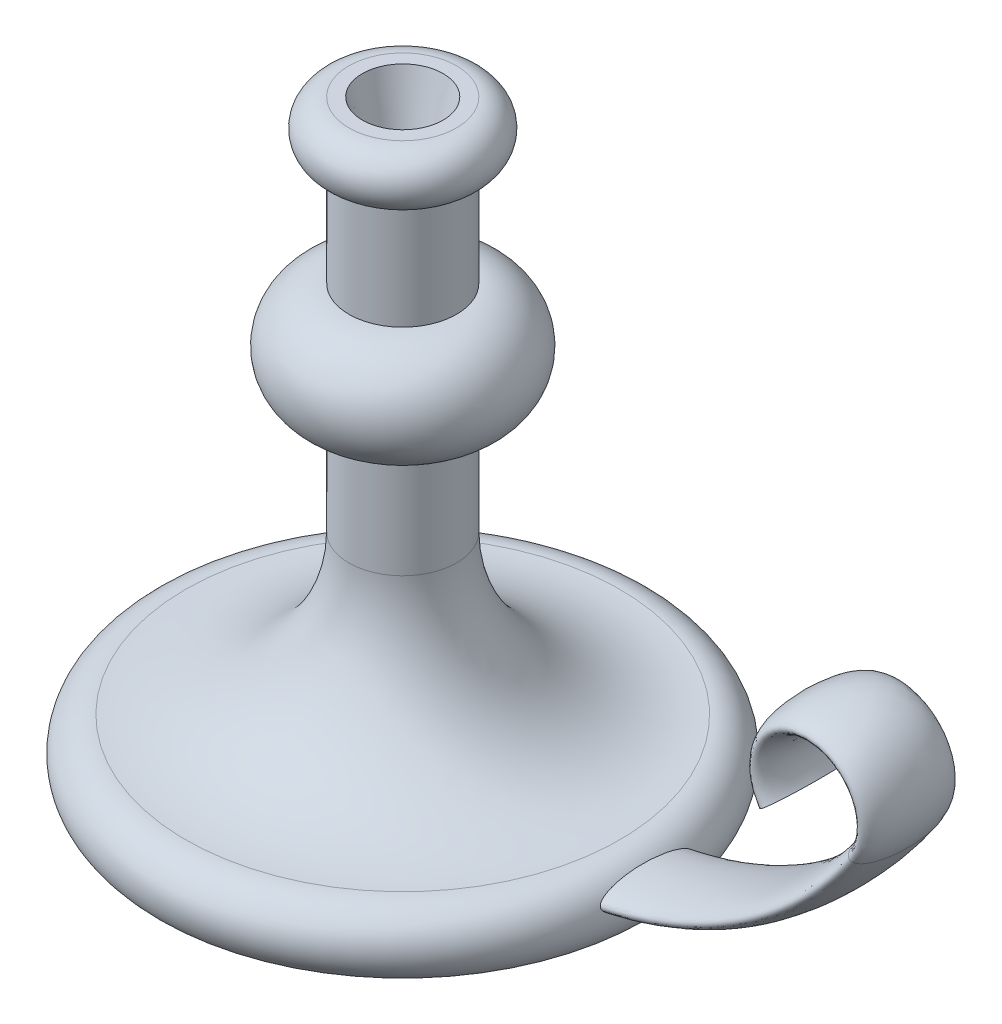
ISO-10303-21;
HEADER;
FILE_DESCRIPTION(('STEP AP214'),'2;1');
FILE_NAME('part.step','',(''),(''),'','','');
FILE_SCHEMA(('AUTOMOTIVE_DESIGN { 1 0 10303 214 1 1 1 1 }'));
ENDSEC;
DATA;
#1=APPLICATION_CONTEXT('core data for automotive mechanical design processes');
#2=APPLICATION_PROTOCOL_DEFINITION('international standard','automotive_design',2000,#1);
#3=PRODUCT_CONTEXT('',#1,'mechanical');
#4=PRODUCT('Part','Part','',(#3));
#5=PRODUCT_RELATED_PRODUCT_CATEGORY('part','',(#4));
#6=PRODUCT_DEFINITION_FORMATION('','',#4);
#7=PRODUCT_DEFINITION_CONTEXT('part definition',#1,'design');
#8=PRODUCT_DEFINITION('design','',#6,#7);
#9=PRODUCT_DEFINITION_SHAPE('','',#8);
#10=(LENGTH_UNIT() NAMED_UNIT(*) SI_UNIT(.MILLI.,.METRE.));
#11=(NAMED_UNIT(*) PLANE_ANGLE_UNIT() SI_UNIT($,.RADIAN.));
#12=(NAMED_UNIT(*) SI_UNIT($,.STERADIAN.) SOLID_ANGLE_UNIT());
#13=UNCERTAINTY_MEASURE_WITH_UNIT(LENGTH_MEASURE(1.E-05),#10,'distance_accuracy_value','');
#14=(GEOMETRIC_REPRESENTATION_CONTEXT(3) GLOBAL_UNCERTAINTY_ASSIGNED_CONTEXT((#13)) GLOBAL_UNIT_ASSIGNED_CONTEXT((#10,
#11,#12)) REPRESENTATION_CONTEXT('',''));
#15=CARTESIAN_POINT('',(0.,0.,0.));
#16=DIRECTION('',(0.,0.,1.));
#17=DIRECTION('',(1.,0.,0.));
#18=AXIS2_PLACEMENT_3D('',#15,#16,#17);
#19=CARTESIAN_POINT('',(0.,220.,0.));
#20=DIRECTION('',(0.,-1.,0.));
#21=DIRECTION('',(1.,0.,0.));
#22=AXIS2_PLACEMENT_3D('',#19,#20,#21);
#23=PLANE('',#22);
#24=CARTESIAN_POINT('',(0.,220.,0.));
#25=DIRECTION('',(0.,1.,0.));
#26=DIRECTION('',(-1.,0.,0.));
#27=AXIS2_PLACEMENT_3D('',#24,#25,#26);
#28=CIRCLE('',#27,15.);
#29=CARTESIAN_POINT('',(-15.,220.,0.));
#30=VERTEX_POINT('',#29);
#31=EDGE_CURVE('E83',#30,#30,#28,.T.);
#32=ORIENTED_EDGE('',*,*,#31,.F.);
#33=EDGE_LOOP('',(#32));
#34=FACE_BOUND('',#33,.T.);
#35=CARTESIAN_POINT('',(0.,220.,0.));
#36=DIRECTION('',(0.,1.,0.));
#37=DIRECTION('',(-1.,0.,0.));
#38=AXIS2_PLACEMENT_3D('',#35,#36,#37);
#39=CIRCLE('',#38,20.);
#40=CARTESIAN_POINT('',(-20.,220.,0.));
#41=VERTEX_POINT('',#40);
#42=EDGE_CURVE('E10',#41,#41,#39,.T.);
#43=ORIENTED_EDGE('',*,*,#42,.T.);
#44=EDGE_LOOP('',(#43));
#45=FACE_BOUND('',#44,.T.);
#46=ADVANCED_FACE('F41',(#34,#45),#23,.F.);
#47=CARTESIAN_POINT('',(0.,210.,0.));
#48=DIRECTION('',(0.,1.,0.));
#49=DIRECTION('',(-1.,0.,0.));
#50=AXIS2_PLACEMENT_3D('',#47,#48,#49);
#51=TOROIDAL_SURFACE('',#50,20.,10.);
#52=ORIENTED_EDGE('',*,*,#42,.F.);
#53=EDGE_LOOP('',(#52));
#54=FACE_BOUND('',#53,.T.);
#55=CARTESIAN_POINT('',(0.,200.,0.));
#56=DIRECTION('',(0.,1.,0.));
#57=DIRECTION('',(-1.,0.,0.));
#58=AXIS2_PLACEMENT_3D('',#55,#56,#57);
#59=CIRCLE('',#58,20.);
#60=CARTESIAN_POINT('',(-20.,200.,0.));
#61=VERTEX_POINT('',#60);
#62=EDGE_CURVE('E53',#61,#61,#59,.T.);
#63=ORIENTED_EDGE('',*,*,#62,.T.);
#64=EDGE_LOOP('',(#63));
#65=FACE_BOUND('',#64,.T.);
#66=ADVANCED_FACE('F90',(#54,#65),#51,.T.);
#67=CARTESIAN_POINT('',(0.,220.,0.));
#68=DIRECTION('',(0.,1.,0.));
#69=DIRECTION('',(-1.,0.,0.));
#70=AXIS2_PLACEMENT_3D('',#67,#68,#69);
#71=CYLINDRICAL_SURFACE('',#70,20.);
#72=ORIENTED_EDGE('',*,*,#62,.F.);
#73=EDGE_LOOP('',(#72));
#74=FACE_BOUND('',#73,.T.);
#75=CARTESIAN_POINT('',(0.,160.,0.));
#76=DIRECTION('',(0.,1.,0.));
#77=DIRECTION('',(-1.,0.,0.));
#78=AXIS2_PLACEMENT_3D('',#75,#76,#77);
#79=CIRCLE('',#78,20.);
#80=CARTESIAN_POINT('',(-20.,160.,0.));
#81=VERTEX_POINT('',#80);
#82=EDGE_CURVE('E57',#81,#81,#79,.T.);
#83=ORIENTED_EDGE('',*,*,#82,.T.);
#84=EDGE_LOOP('',(#83));
#85=FACE_BOUND('',#84,.T.);
#86=ADVANCED_FACE('F94',(#74,#85),#71,.T.);
#87=CARTESIAN_POINT('',(0.,140.,0.));
#88=DIRECTION('',(0.,1.,0.));
#89=DIRECTION('',(-1.,0.,0.));
#90=AXIS2_PLACEMENT_3D('',#87,#88,#89);
#91=TOROIDAL_SURFACE('',#90,20.,20.);
#92=ORIENTED_EDGE('',*,*,#82,.F.);
#93=EDGE_LOOP('',(#92));
#94=FACE_BOUND('',#93,.T.);
#95=CARTESIAN_POINT('',(0.,120.,0.));
#96=DIRECTION('',(0.,1.,0.));
#97=DIRECTION('',(-1.,0.,0.));
#98=AXIS2_PLACEMENT_3D('',#95,#96,#97);
#99=CIRCLE('',#98,20.);
#100=CARTESIAN_POINT('',(-20.,120.,0.));
#101=VERTEX_POINT('',#100);
#102=EDGE_CURVE('E62',#101,#101,#99,.T.);
#103=ORIENTED_EDGE('',*,*,#102,.T.);
#104=EDGE_LOOP('',(#103));
#105=FACE_BOUND('',#104,.T.);
#106=ADVANCED_FACE('F99',(#94,#105),#91,.T.);
#107=CARTESIAN_POINT('',(0.,220.,0.));
#108=DIRECTION('',(0.,1.,0.));
#109=DIRECTION('',(-1.,0.,0.));
#110=AXIS2_PLACEMENT_3D('',#107,#108,#109);
#111=CYLINDRICAL_SURFACE('',#110,20.);
#112=ORIENTED_EDGE('',*,*,#102,.F.);
#113=EDGE_LOOP('',(#112));
#114=FACE_BOUND('',#113,.T.);
#115=CARTESIAN_POINT('',(0.,80.,0.));
#116=DIRECTION('',(0.,1.,0.));
#117=DIRECTION('',(-1.,0.,0.));
#118=AXIS2_PLACEMENT_3D('',#115,#116,#117);
#119=CIRCLE('',#118,20.);
#120=CARTESIAN_POINT('',(-20.0000000000001,80.,0.));
#121=VERTEX_POINT('',#120);
#122=EDGE_CURVE('E65',#121,#121,#119,.T.);
#123=ORIENTED_EDGE('',*,*,#122,.T.);
#124=EDGE_LOOP('',(#123));
#125=FACE_BOUND('',#124,.T.);
#126=ADVANCED_FACE('F106',(#114,#125),#111,.T.);
#127=CARTESIAN_POINT('',(0.,79.9999999999999,0.));
#128=DIRECTION('',(0.,1.,0.));
#129=DIRECTION('',(-1.,0.,0.));
#130=AXIS2_PLACEMENT_3D('',#127,#128,#129);
#131=TOROIDAL_SURFACE('',#130,78.8204265996985,58.8204265996985);
#132=ORIENTED_EDGE('',*,*,#122,.F.);
#133=EDGE_LOOP('',(#132));
#134=FACE_BOUND('',#133,.T.);
#135=CARTESIAN_POINT('',(0.,21.2080168194294,0.));
#136=DIRECTION('',(0.,1.,0.));
#137=DIRECTION('',(-1.,0.,0.));
#138=AXIS2_PLACEMENT_3D('',#135,#136,#137);
#139=CIRCLE('',#138,80.6494424733396);
#140=CARTESIAN_POINT('',(-80.6494424733396,21.2080168194294,0.));
#141=VERTEX_POINT('',#140);
#142=EDGE_CURVE('E68',#141,#141,#139,.T.);
#143=ORIENTED_EDGE('',*,*,#142,.T.);
#144=EDGE_LOOP('',(#143));
#145=FACE_BOUND('',#144,.T.);
#146=ADVANCED_FACE('F110',(#134,#145),#131,.F.);
#147=CARTESIAN_POINT('',(0.,8.71406136483062,0.));
#148=DIRECTION('',(0.,1.,0.));
#149=DIRECTION('',(-1.,0.,0.));
#150=AXIS2_PLACEMENT_3D('',#147,#148,#149);
#151=TOROIDAL_SURFACE('',#150,81.0381288488415,12.5);
#152=CARTESIAN_POINT('',(91.0218392214389,13.2429030972635,-17.5));
#153=CARTESIAN_POINT('',(91.0387237271424,13.2002476881049,-17.5000010450082));
#154=CARTESIAN_POINT('',(91.0557256233928,13.1576463015099,-17.4978455510409));
#155=CARTESIAN_POINT('',(91.08982673329,13.0729013238701,-17.4893177006165));
#156=CARTESIAN_POINT('',(91.1069259737739,13.0307578694164,-17.4829441192878));
#157=CARTESIAN_POINT('',(91.1581944372523,12.9054382936846,-17.4577561719923));
#158=CARTESIAN_POINT('',(91.1923166826997,12.8234177058011,-17.4328749261469));
#159=CARTESIAN_POINT('',(91.2690475015181,12.6418603320258,-17.3606410003538));
#160=CARTESIAN_POINT('',(91.3113126896798,12.5439679698587,-17.3089122311868));
#161=CARTESIAN_POINT('',(91.3933694533119,12.3573702711873,-17.1893973539373));
#162=CARTESIAN_POINT('',(91.4331545886019,12.2686884852105,-17.1215714729396));
#163=CARTESIAN_POINT('',(91.505463574309,12.1101803480161,-16.9835994785153));
#164=CARTESIAN_POINT('',(91.5382854213837,12.039368843571,-16.9147121478811));
#165=CARTESIAN_POINT('',(91.6020617404435,11.9036348173224,-16.7705071809718));
#166=CARTESIAN_POINT('',(91.6330146036928,11.8387173452948,-16.6951841360838));
#167=CARTESIAN_POINT('',(91.6932559853178,11.7139518609917,-16.5396246780461));
#168=CARTESIAN_POINT('',(91.722541410897,11.654113174187,-16.4593796735374));
#169=CARTESIAN_POINT('',(91.779560231776,11.5389593308511,-16.2952422137553));
#170=CARTESIAN_POINT('',(91.80729407397,11.4836428696683,-16.2113508212303));
#171=CARTESIAN_POINT('',(91.8651736049462,11.3694451361373,-16.0287299301955));
#172=CARTESIAN_POINT('',(91.8951122232932,11.3111515442047,-15.929569221302));
#173=CARTESIAN_POINT('',(91.9533999684463,11.1989441897543,-15.7283485441093));
#174=CARTESIAN_POINT('',(91.9817489100778,11.1450309371565,-15.6262882401263));
#175=CARTESIAN_POINT('',(92.0369779426886,11.0411030461374,-15.4200379172818));
#176=CARTESIAN_POINT('',(92.0638603063223,10.9910823212896,-15.3158515584475));
#177=CARTESIAN_POINT('',(92.1163401066507,10.8943887060286,-15.1056348437027));
#178=CARTESIAN_POINT('',(92.1419376232365,10.8477156073839,-14.9996046029973));
#179=CARTESIAN_POINT('',(92.2005199418423,10.7418774740482,-14.749494354725));
#180=CARTESIAN_POINT('',(92.2330372212628,10.6838992432133,-14.6048030012611));
#181=CARTESIAN_POINT('',(92.2961935918206,10.5725469519067,-14.313244632093));
#182=CARTESIAN_POINT('',(92.3268324204339,10.5191735345611,-14.1663773158309));
#183=CARTESIAN_POINT('',(92.3864357534422,10.4164111992929,-13.8707358868182));
#184=CARTESIAN_POINT('',(92.415398373899,10.3670267409322,-13.7219598496574));
#185=CARTESIAN_POINT('',(92.4717537495937,10.2718508982848,-13.422964440171));
#186=CARTESIAN_POINT('',(92.4991464054596,10.2260597413705,-13.2727449771839));
#187=CARTESIAN_POINT('',(92.5791718538912,10.09345947671,-12.8201450664608));
#188=CARTESIAN_POINT('',(92.6296248158832,10.0114703155529,-12.5159601751972));
#189=CARTESIAN_POINT('',(92.7256509795061,9.85770615403591,-11.9025949872641));
#190=CARTESIAN_POINT('',(92.7711976361288,9.78598608702627,-11.5933970058159));
#191=CARTESIAN_POINT('',(92.857568269172,9.65172377774597,-10.9726212442378));
#192=CARTESIAN_POINT('',(92.8983957881055,9.58917464154142,-10.6610454388513));
#193=CARTESIAN_POINT('',(92.9757170765173,9.47203235998278,-10.0359313731458));
#194=CARTESIAN_POINT('',(93.0122115267146,9.41743796464287,-9.72239342924477));
#195=CARTESIAN_POINT('',(93.0839389434969,9.3111693379989,-9.06820396965003));
#196=CARTESIAN_POINT('',(93.1188288179072,9.26009224748253,-8.72741824390393));
#197=CARTESIAN_POINT('',(93.1841160733915,9.16535652767351,-8.04438148717035));
#198=CARTESIAN_POINT('',(93.2145132603926,9.12169821884143,-7.7021303935394));
#199=CARTESIAN_POINT('',(93.271012519265,9.04115155210228,-7.01638121626511));
#200=CARTESIAN_POINT('',(93.2971133489208,9.004265151818,-6.67288280121893));
#201=CARTESIAN_POINT('',(93.3451537997318,8.93679113480079,-5.98497371045576));
#202=CARTESIAN_POINT('',(93.3670932781325,8.90620373415108,-5.64056300385354));
#203=CARTESIAN_POINT('',(93.4267381815512,8.82344746410236,-4.60806585396849));
#204=CARTESIAN_POINT('',(93.4584177235097,8.78007657489712,-3.91890377289669));
#205=CARTESIAN_POINT('',(93.5062518933377,8.71486697491152,-2.53904459995606));
#206=CARTESIAN_POINT('',(93.5224060871702,8.6930288661157,-1.84834746571327));
#207=CARTESIAN_POINT('',(93.5384150423668,8.67139588101243,-0.549996569407947));
#208=CARTESIAN_POINT('',(93.5400047236096,8.66925458453172,0.0575983568372195));
#209=CARTESIAN_POINT('',(93.5314017384323,8.68087045506801,1.27264756848925));
#210=CARTESIAN_POINT('',(93.5212073043764,8.69463000723722,1.8801018191223));
#211=CARTESIAN_POINT('',(93.4889027208428,8.7384904131166,3.09430826504117));
#212=CARTESIAN_POINT('',(93.4667887326513,8.76859653129061,3.70106017101466));
#213=CARTESIAN_POINT('',(93.4102999361791,8.8462260956102,4.91398988569018));
#214=CARTESIAN_POINT('',(93.3759030279974,8.89378094044514,5.52016467198355));
#215=CARTESIAN_POINT('',(93.2943595907772,9.00800592306139,6.72974297132933));
#216=CARTESIAN_POINT('',(93.2472164422581,9.07467099276872,7.3331471760958));
#217=CARTESIAN_POINT('',(93.1663269057562,9.19110129324903,8.23503212277021));
#218=CARTESIAN_POINT('',(93.137676306246,9.23263781601772,8.53504939957939));
#219=CARTESIAN_POINT('',(93.0768277820127,9.32170425147748,9.13382743847568));
#220=CARTESIAN_POINT('',(93.0446300100418,9.36923390609862,9.43258825409512));
#221=CARTESIAN_POINT('',(92.9764629967327,9.47096640593128,10.0288581938314));
#222=CARTESIAN_POINT('',(92.940489997118,9.52517591052781,10.3263657580075));
#223=CARTESIAN_POINT('',(92.8645434850019,9.64106284984119,10.919465661459));
#224=CARTESIAN_POINT('',(92.8245693802273,9.70274139046458,11.21505771027));
#225=CARTESIAN_POINT('',(92.7402632087426,9.83469285963899,11.8039351577575));
#226=CARTESIAN_POINT('',(92.6959280509754,9.90497189284494,12.0972187588887));
#227=CARTESIAN_POINT('',(92.6025776730023,10.0553946041886,12.6797774700146));
#228=CARTESIAN_POINT('',(92.5535734028715,10.135515323251,12.9690602215732));
#229=CARTESIAN_POINT('',(92.4501940228296,10.3077493433548,13.5429619485965));
#230=CARTESIAN_POINT('',(92.3958218177353,10.3998561667006,13.827583350341));
#231=CARTESIAN_POINT('',(92.3095576658701,10.5492476463075,14.2493983603303));
#232=CARTESIAN_POINT('',(92.2800345732429,10.6008880643727,14.389081965422));
#233=CARTESIAN_POINT('',(92.2192495390011,10.7084556526518,14.666398704985));
#234=CARTESIAN_POINT('',(92.1879877882503,10.7643823525861,14.8040320624309));
#235=CARTESIAN_POINT('',(92.1229963357037,10.8821323129919,15.0789842751265));
#236=CARTESIAN_POINT('',(92.0892344863866,10.944037464005,15.2162606818074));
#237=CARTESIAN_POINT('',(92.0194326577583,11.0738463544431,15.487436549884));
#238=CARTESIAN_POINT('',(91.9833919665493,11.1417519710408,15.6213349375471));
#239=CARTESIAN_POINT('',(91.9088363081799,11.2844351476636,15.8840885039224));
#240=CARTESIAN_POINT('',(91.8703306214983,11.3591873417771,16.0129599623785));
#241=CARTESIAN_POINT('',(91.7903231869532,11.5172184910703,16.264342709207));
#242=CARTESIAN_POINT('',(91.7488237961295,11.600490759272,16.3868588734261));
#243=CARTESIAN_POINT('',(91.6677322485553,11.7663982109835,16.6079145689105));
#244=CARTESIAN_POINT('',(91.6285584376418,11.8477920816342,16.7075302401066));
#245=CARTESIAN_POINT('',(91.5469777422452,12.0205144146608,16.8970368877778));
#246=CARTESIAN_POINT('',(91.5045640197906,12.1118640726817,16.9869062704744));
#247=CARTESIAN_POINT('',(91.4380483127567,12.2581701532586,17.1110794609954));
#248=CARTESIAN_POINT('',(91.4151921305341,12.3089462100449,17.1509837393849));
#249=CARTESIAN_POINT('',(91.3686001083926,12.4136019083811,17.2259928563444));
#250=CARTESIAN_POINT('',(91.3448641115573,12.4674821045184,17.2610968334868));
#251=CARTESIAN_POINT('',(91.2966903130685,12.5781105716414,17.3252675570636));
#252=CARTESIAN_POINT('',(91.2722560228595,12.6348453122441,17.3543599608046));
#253=CARTESIAN_POINT('',(91.2227756992792,12.751121890448,17.4054703044572));
#254=CARTESIAN_POINT('',(91.1977302297037,12.8106611848378,17.42749451749));
#255=CARTESIAN_POINT('',(91.1410771944871,12.9470124234379,17.4676994584011));
#256=CARTESIAN_POINT('',(91.1093676315408,13.024477396563,17.4836104825565));
#257=CARTESIAN_POINT('',(91.0462370284459,13.1811095530926,17.5009169471864));
#258=CARTESIAN_POINT('',(91.0148158270557,13.2602756905549,17.5023210648644));
#259=CARTESIAN_POINT('',(90.9531839913537,13.4178903951082,17.4904060494174));
#260=CARTESIAN_POINT('',(90.9229726197553,13.4963393760341,17.4770960292584));
#261=CARTESIAN_POINT('',(90.86442681096,13.6504791561979,17.437121949978));
#262=CARTESIAN_POINT('',(90.8360942951915,13.7261670973129,17.4104444518886));
#263=CARTESIAN_POINT('',(90.7703570694519,13.9039847662509,17.3325924653588));
#264=CARTESIAN_POINT('',(90.734063025823,14.0040624046424,17.2758469027692));
#265=CARTESIAN_POINT('',(90.6658119508761,14.195026715119,17.1465368030925));
#266=CARTESIAN_POINT('',(90.6338663052993,14.2858891056301,17.0739319863792));
#267=CARTESIAN_POINT('',(90.5767998907113,14.4501776256653,16.9257752102006));
#268=CARTESIAN_POINT('',(90.5513155909637,14.5244376822049,16.8512661984322));
#269=CARTESIAN_POINT('',(90.5028908556559,14.6668472266296,16.6957998671665));
#270=CARTESIAN_POINT('',(90.4799526685986,14.7349913034129,16.6148369548542));
#271=CARTESIAN_POINT('',(90.4361642018432,14.8660732250277,16.4479752839859));
#272=CARTESIAN_POINT('',(90.4153191927272,14.9289978614348,16.3620648824458));
#273=CARTESIAN_POINT('',(90.3754359846482,15.050152434354,16.1866658763681));
#274=CARTESIAN_POINT('',(90.3563971328333,15.1083840660407,16.0971785814825));
#275=CARTESIAN_POINT('',(90.3195006263767,15.221809759901,15.9137412560003));
#276=CARTESIAN_POINT('',(90.3016708994802,15.2769289097323,15.81973956638));
#277=CARTESIAN_POINT('',(90.2673446284714,15.3834812490698,15.6294239161183));
#278=CARTESIAN_POINT('',(90.250848322113,15.4349137810535,15.5331095470709));
#279=CARTESIAN_POINT('',(90.2030174296424,15.5844992870425,15.2410936889848));
#280=CARTESIAN_POINT('',(90.17339639789,15.6777684404554,15.0426047503192));
#281=CARTESIAN_POINT('',(90.1175941173176,15.8539596330478,14.6404944087312));
#282=CARTESIAN_POINT('',(90.0914158890751,15.9368725829473,14.4368686831971));
#283=CARTESIAN_POINT('',(90.0416849833099,16.0944302433251,14.0251133598403));
#284=CARTESIAN_POINT('',(90.0181443015335,16.1690371683792,13.8169679475742));
#285=CARTESIAN_POINT('',(89.9733292907841,16.3108246572343,13.3982065197802));
#286=CARTESIAN_POINT('',(89.9520524360155,16.378013500755,13.1875935550073));
#287=CARTESIAN_POINT('',(89.9113753607474,16.5060416166984,12.7643407233213));
#288=CARTESIAN_POINT('',(89.8919746398093,16.5668825826935,12.5517014136311));
#289=CARTESIAN_POINT('',(89.849689734785,16.6988851969988,12.0664042902698));
#290=CARTESIAN_POINT('',(89.827303648487,16.7683197752758,11.7932342142552));
#291=CARTESIAN_POINT('',(89.7847399444103,16.8993897784799,11.2448451823775));
#292=CARTESIAN_POINT('',(89.7645625501311,16.961024414222,10.9696260221697));
#293=CARTESIAN_POINT('',(89.7261443388086,17.0774237057835,10.4174622394428));
#294=CARTESIAN_POINT('',(89.7079045187843,17.1321848272996,10.1405168054847));
#295=CARTESIAN_POINT('',(89.673191480252,17.2355001446269,9.58535578516326));
#296=CARTESIAN_POINT('',(89.6567183450058,17.2840540479199,9.30714013957989));
#297=CARTESIAN_POINT('',(89.6098418487414,17.4209981276742,8.47258351512837));
#298=CARTESIAN_POINT('',(89.5818709393478,17.5010033813077,7.91471752766468));
#299=CARTESIAN_POINT('',(89.5318782113459,17.6417650717487,6.79648556429593));
#300=CARTESIAN_POINT('',(89.5098550083066,17.7025259885764,6.23612020108643));
#301=CARTESIAN_POINT('',(89.4715961567931,17.8067228687609,5.11511479744723));
#302=CARTESIAN_POINT('',(89.4553451258032,17.8502049166816,4.5544795353117));
#303=CARTESIAN_POINT('',(89.4284966459205,17.9213978205087,3.43205273933566));
#304=CARTESIAN_POINT('',(89.4178995226105,17.9491077681778,2.87026114077662));
#305=CARTESIAN_POINT('',(89.4023700642639,17.9895383139046,1.74600450065262));
#306=CARTESIAN_POINT('',(89.397438340362,18.0022572948694,1.18353939298514));
#307=CARTESIAN_POINT('',(89.3932573100072,18.013047530467,0.0584630429635961));
#308=CARTESIAN_POINT('',(89.3940078605346,18.0111191537656,-0.504148195356027));
#309=CARTESIAN_POINT('',(89.4011862427475,17.9925685699135,-1.62877069375065));
#310=CARTESIAN_POINT('',(89.4076108125585,17.9759548050793,-2.19078211282294));
#311=CARTESIAN_POINT('',(89.4261152567334,17.9275888415274,-3.3140874002313));
#312=CARTESIAN_POINT('',(89.4381953329093,17.8958361025867,-3.87538124224446));
#313=CARTESIAN_POINT('',(89.4680278902417,17.8162319822171,-4.99734675397808));
#314=CARTESIAN_POINT('',(89.4857870295396,17.7683617010583,-5.55801691435686));
#315=CARTESIAN_POINT('',(89.5270487170515,17.655058415788,-6.67735290890778));
#316=CARTESIAN_POINT('',(89.5505507406534,17.5896270158303,-7.23601892143143));
#317=CARTESIAN_POINT('',(89.5922123610219,17.4712124574237,-8.11144011809288));
#318=CARTESIAN_POINT('',(89.6083414978801,17.4249222943288,-8.4292052408542));
#319=CARTESIAN_POINT('',(89.6426776988952,17.3252459244219,-9.06353315837383));
#320=CARTESIAN_POINT('',(89.6608848665617,17.2718593641066,-9.38009589242721));
#321=CARTESIAN_POINT('',(89.6995463411571,17.1572165517864,-10.0117529664032));
#322=CARTESIAN_POINT('',(89.7200012677411,17.0959581288995,-10.3268468763239));
#323=CARTESIAN_POINT('',(89.7633490855456,16.9647664672953,-10.9541447499507));
#324=CARTESIAN_POINT('',(89.7862349923713,16.8948579902991,-11.2663543341677));
#325=CARTESIAN_POINT('',(89.8348735399245,16.7449224096902,-11.8880526187848));
#326=CARTESIAN_POINT('',(89.8606255734877,16.6648974486817,-12.1975418805298));
#327=CARTESIAN_POINT('',(89.9155758463715,16.4929428713543,-12.8127795932354));
#328=CARTESIAN_POINT('',(89.9447723782013,16.4010191512554,-13.1185298154237));
#329=CARTESIAN_POINT('',(89.9901864913607,16.2575097730331,-13.557054198979));
#330=CARTESIAN_POINT('',(90.0046462277531,16.2117493613147,-13.6919261319589));
#331=CARTESIAN_POINT('',(90.0345661378114,16.1169961747357,-13.9604247039184));
#332=CARTESIAN_POINT('',(90.0500263188945,16.0680033759105,-14.094051333657));
#333=CARTESIAN_POINT('',(90.0821318664633,15.9662860764166,-14.360121742191));
#334=CARTESIAN_POINT('',(90.0987800706745,15.9135526427458,-14.4925617763892));
#335=CARTESIAN_POINT('',(90.1334153884612,15.8039938816352,-14.7555602791059));
#336=CARTESIAN_POINT('',(90.1514024365647,15.7471687542912,-14.8861188392599));
#337=CARTESIAN_POINT('',(90.1909444520427,15.622577872307,-15.1585765358867));
#338=CARTESIAN_POINT('',(90.2126755571481,15.5542907138133,-15.3002135620826));
#339=CARTESIAN_POINT('',(90.2585123771174,15.4109493265847,-15.5797403637165));
#340=CARTESIAN_POINT('',(90.2826191238791,15.3358921583983,-15.7176284772802));
#341=CARTESIAN_POINT('',(90.3336960644792,15.1779918768142,-15.9876667226701));
#342=CARTESIAN_POINT('',(90.3606553160639,15.095178646876,-16.119836224442));
#343=CARTESIAN_POINT('',(90.4182965589345,14.9198501153096,-16.3766482828942));
#344=CARTESIAN_POINT('',(90.4489742837141,14.8273459491186,-16.5012992247445));
#345=CARTESIAN_POINT('',(90.5083259171889,14.6507402239064,-16.7147573665486));
#346=CARTESIAN_POINT('',(90.5360990560993,14.5688659703857,-16.80564150509));
#347=CARTESIAN_POINT('',(90.5954966053098,14.3960192072345,-16.9775509986329));
#348=CARTESIAN_POINT('',(90.6271273436289,14.3050317932496,-17.0585597066897));
#349=CARTESIAN_POINT('',(90.6782405709683,14.1603299223934,-17.1694834790196));
#350=CARTESIAN_POINT('',(90.6960555843429,14.1102682181019,-17.2049457829461));
#351=CARTESIAN_POINT('',(90.732939653224,14.0075205127295,-17.2711792990068));
#352=CARTESIAN_POINT('',(90.7520089418508,13.9548340242486,-17.3019496355424));
#353=CARTESIAN_POINT('',(90.7913328871427,13.8472131800932,-17.3577030771711));
#354=CARTESIAN_POINT('',(90.8115817364892,13.7922901813172,-17.3827119545785));
#355=CARTESIAN_POINT('',(90.8532728609314,13.6803548625301,-17.426099014347));
#356=CARTESIAN_POINT('',(90.8747139060557,13.6233447158115,-17.4444838892839));
#357=CARTESIAN_POINT('',(90.9168039777965,13.5126333832182,-17.4725282104178));
#358=CARTESIAN_POINT('',(90.9373696287499,13.459053425713,-17.4827880802029));
#359=CARTESIAN_POINT('',(90.9791734544596,13.3512544554109,-17.4965242253452));
#360=CARTESIAN_POINT('',(91.0004118087682,13.2970352744639,-17.4999986738243));
#361=CARTESIAN_POINT('',(91.0218392214389,13.2429030972635,-17.5));
#362=B_SPLINE_CURVE_WITH_KNOTS('',3,(#152,#153,#154,#155,#156,#157,#158,#159,#160,#161,#162,
#163,#164,#165,#166,#167,#168,#169,#170,#171,#172,#173,#174,#175,#176,#177,#178,#179,#180,#181,
#182,#183,#184,#185,#186,#187,#188,#189,#190,#191,#192,#193,#194,#195,#196,#197,#198,#199,#200,
#201,#202,#203,#204,#205,#206,#207,#208,#209,#210,#211,#212,#213,#214,#215,#216,#217,#218,#219,
#220,#221,#222,#223,#224,#225,#226,#227,#228,#229,#230,#231,#232,#233,#234,#235,#236,#237,#238,
#239,#240,#241,#242,#243,#244,#245,#246,#247,#248,#249,#250,#251,#252,#253,#254,#255,#256,#257,
#258,#259,#260,#261,#262,#263,#264,#265,#266,#267,#268,#269,#270,#271,#272,#273,#274,#275,#276,
#277,#278,#279,#280,#281,#282,#283,#284,#285,#286,#287,#288,#289,#290,#291,#292,#293,#294,#295,
#296,#297,#298,#299,#300,#301,#302,#303,#304,#305,#306,#307,#308,#309,#310,#311,#312,#313,#314,
#315,#316,#317,#318,#319,#320,#321,#322,#323,#324,#325,#326,#327,#328,#329,#330,#331,#332,#333,
#334,#335,#336,#337,#338,#339,#340,#341,#342,#343,#344,#345,#346,#347,#348,#349,#350,#351,#352,
#353,#354,#355,#356,#357,#358,#359,#360,#361),.UNSPECIFIED.,.T.,.F.,(4,2,2,2,2,2,2,2,2,2,2,2,2,
2,2,2,2,2,2,2,2,2,2,2,2,2,2,2,2,2,2,2,2,2,2,2,2,2,2,2,2,2,2,2,2,2,2,2,2,2,2,2,2,2,2,2,2,2,2,2,2,
2,2,2,2,2,2,2,2,2,2,2,2,2,2,2,2,2,2,2,2,2,2,2,2,2,2,2,2,2,2,2,2,2,2,2,2,2,2,2,2,2,2,2,4),(0.,
0.137561522049945,0.275163007511283,0.550508181604677,0.904085199479369,1.25854510519134,
1.57040007566282,1.88251975852079,2.19520067475289,2.50779106257442,2.86421092351483,
3.22067221640414,3.57656444717481,3.93243452124171,4.41001167852805,4.88765542849573,
5.36582598744755,5.84402677913513,6.80087003064575,7.76265450959604,8.7237122518133,
9.68461881285158,10.7235557638795,11.7625375812661,12.8018192761204,13.8411366169428,
15.9142902760582,17.9875018919735,19.8099884017018,21.6327483227517,23.4560956179509,
25.2827402175103,27.1089008343347,28.0215277353855,28.934115351269,29.8476202335008,
30.7612605400521,31.6755531541436,32.5877519943264,33.4994598830218,33.9548587592283,
34.4102077415894,34.8730501363295,35.3360378418003,35.7973747188136,36.2583522534485,
36.6612567011877,37.0650363286325,37.2703575238655,37.475715516349,37.680178065812,
37.8844586467377,38.138872314405,38.3931337975205,38.6472378960281,38.9015979717008,
39.2614480464455,39.6222229280122,39.9464645151851,40.2709902033627,40.5963135637228,
40.9215188813828,41.2526643554565,41.5838687443871,42.2472877606451,42.9112850053249,
43.5781890741073,44.2443410852653,44.9103149144884,45.7583959016398,46.6065626277018,
47.4551637027664,48.3038047538305,49.9961323262105,51.6880656400584,53.3754556050395,
55.0629427286493,56.7506118667929,58.4382385273935,60.1248956379382,61.811612940068,
63.5003150469425,65.1888629485932,66.153362807613,67.1179107307134,68.0827252275165,
69.0448391027672,70.0067495489903,70.9681851492652,71.3976163557092,71.8270507462651,
72.2575476363729,72.6880234882036,73.1640573667776,73.6402989373479,74.1147756777642,
74.5887130761368,74.9644989292621,75.3409097305837,75.532369642391,75.7238652401632,
75.914486840236,76.1049153016644,76.2794418338144,76.4540153482747),.UNSPECIFIED.);
#363=CARTESIAN_POINT('',(91.0218392214389,13.2429030972635,-17.5));
#364=VERTEX_POINT('',#363);
#365=EDGE_CURVE('E44',#364,#364,#362,.T.);
#366=ORIENTED_EDGE('',*,*,#365,.T.);
#367=EDGE_LOOP('',(#366));
#368=FACE_BOUND('',#367,.T.);
#369=ORIENTED_EDGE('',*,*,#142,.F.);
#370=EDGE_LOOP('',(#369));
#371=FACE_BOUND('',#370,.T.);
#372=CARTESIAN_POINT('',(0.,0.,0.));
#373=DIRECTION('',(0.,1.,0.));
#374=DIRECTION('',(-1.,0.,0.));
#375=AXIS2_PLACEMENT_3D('',#372,#373,#374);
#376=CIRCLE('',#375,90.);
#377=CARTESIAN_POINT('',(-90.,0.,0.));
#378=VERTEX_POINT('',#377);
#379=EDGE_CURVE('E71',#378,#378,#376,.T.);
#380=ORIENTED_EDGE('',*,*,#379,.T.);
#381=EDGE_LOOP('',(#380));
#382=FACE_BOUND('',#381,.T.);
#383=ADVANCED_FACE('F113',(#368,#371,#382),#151,.T.);
#384=CARTESIAN_POINT('',(0.,0.,0.));
#385=DIRECTION('',(0.,1.,0.));
#386=DIRECTION('',(-1.,0.,0.));
#387=AXIS2_PLACEMENT_3D('',#384,#385,#386);
#388=PLANE('',#387);
#389=ORIENTED_EDGE('',*,*,#379,.F.);
#390=EDGE_LOOP('',(#389));
#391=FACE_BOUND('',#390,.T.);
#392=ADVANCED_FACE('F118',(#391),#388,.F.);
#393=CARTESIAN_POINT('',(60.,10.,-17.5));
#394=CARTESIAN_POINT('',(110.410191303973,10.,-17.5));
#395=CARTESIAN_POINT('',(155.026295870831,33.4646670673665,-17.5));
#396=CARTESIAN_POINT('',(183.592070943083,75.,-17.5));
#397=CARTESIAN_POINT('',(60.,20.,-17.5));
#398=CARTESIAN_POINT('',(107.049511883708,20.,-17.5));
#399=CARTESIAN_POINT('',(148.691209479442,41.9003559295421,-17.5));
#400=CARTESIAN_POINT('',(175.352599546877,80.6666666666666,-17.5));
#401=CARTESIAN_POINT('',(60.,20.,17.5));
#402=CARTESIAN_POINT('',(107.049511883708,20.,17.5));
#403=CARTESIAN_POINT('',(148.691209479442,41.9003559295421,17.5));
#404=CARTESIAN_POINT('',(175.352599546877,80.6666666666666,17.5));
#405=CARTESIAN_POINT('',(60.,10.,17.5));
#406=CARTESIAN_POINT('',(110.410191303973,10.,17.5));
#407=CARTESIAN_POINT('',(155.026295870831,33.4646670673665,17.5));
#408=CARTESIAN_POINT('',(183.592070943083,75.,17.5));
#409=CARTESIAN_POINT('',(60.,0.,17.5));
#410=CARTESIAN_POINT('',(113.770870724238,0.,17.5));
#411=CARTESIAN_POINT('',(161.36138226222,25.0289782051909,17.5));
#412=CARTESIAN_POINT('',(191.831542339288,69.3333333333333,17.5));
#413=CARTESIAN_POINT('',(60.,0.,-17.5));
#414=CARTESIAN_POINT('',(113.770870724238,0.,-17.5));
#415=CARTESIAN_POINT('',(161.36138226222,25.0289782051909,-17.5));
#416=CARTESIAN_POINT('',(191.831542339288,69.3333333333333,-17.5));
#417=CARTESIAN_POINT('',(60.,10.,-17.5));
#418=CARTESIAN_POINT('',(110.410191303973,10.,-17.5));
#419=CARTESIAN_POINT('',(155.026295870831,33.4646670673665,-17.5));
#420=CARTESIAN_POINT('',(183.592070943083,75.,-17.5));
#421=(BOUNDED_SURFACE() B_SPLINE_SURFACE(3,3,((#393,#394,#395,#396),(#397,#398,#399,#400),(#401,
#402,#403,#404),(#405,#406,#407,#408),(#409,#410,#411,#412),(#413,#414,#415,#416),(#417,#418,
#419,#420)),.UNSPECIFIED.,.T.,.F.,.F.) B_SPLINE_SURFACE_WITH_KNOTS((4,3,4),(4,4),(0.,0.5,1.),
(0.,1.),.UNSPECIFIED.) GEOMETRIC_REPRESENTATION_ITEM() RATIONAL_B_SPLINE_SURFACE(((1.,
0.923374135437856,0.923374135437856,1.),(0.333333333333333,0.307791378479285,0.307791378479285,
0.333333333333333),(0.333333333333333,0.307791378479285,0.307791378479285,0.333333333333333),
(1.,0.923374135437856,0.923374135437856,1.),(0.333333333333333,0.307791378479285,
0.307791378479285,0.333333333333333),(0.333333333333333,0.307791378479285,0.307791378479285,
0.333333333333333),(1.,0.923374135437856,0.923374135437856,1.))) REPRESENTATION_ITEM('') SURFACE());
#422=CARTESIAN_POINT('',(183.592070943083,75.,0.));
#423=DIRECTION('',(0.566666666666667,0.823947139620552,0.));
#424=DIRECTION('',(0.,0.,-1.));
#425=AXIS2_PLACEMENT_3D('',#422,#423,#424);
#426=ELLIPSE('',#425,17.5,5.);
#427=CARTESIAN_POINT('',(183.592070943083,75.,-17.5));
#428=VERTEX_POINT('',#427);
#429=EDGE_CURVE('E77',#428,#428,#426,.T.);
#430=ORIENTED_EDGE('',*,*,#429,.F.);
#431=EDGE_LOOP('',(#430));
#432=FACE_BOUND('',#431,.T.);
#433=ORIENTED_EDGE('',*,*,#365,.F.);
#434=EDGE_LOOP('',(#433));
#435=FACE_BOUND('',#434,.T.);
#436=ADVANCED_FACE('F122',(#432,#435),#421,.T.);
#437=CARTESIAN_POINT('',(150.634185358261,75.,0.));
#438=DIRECTION('',(0.566666666666667,-0.823947139620552,0.));
#439=DIRECTION('',(0.,0.,-1.));
#440=AXIS2_PLACEMENT_3D('',#437,#438,#439);
#441=PLANE('',#440);
#442=CARTESIAN_POINT('',(150.634185358261,75.,0.));
#443=DIRECTION('',(0.566666666666667,-0.823947139620552,0.));
#444=DIRECTION('',(0.,0.,-1.));
#445=AXIS2_PLACEMENT_3D('',#442,#443,#444);
#446=ELLIPSE('',#445,17.5,5.);
#447=CARTESIAN_POINT('',(150.634185358261,75.,-17.5));
#448=VERTEX_POINT('',#447);
#449=EDGE_CURVE('E74',#448,#448,#446,.T.);
#450=ORIENTED_EDGE('',*,*,#449,.T.);
#451=EDGE_LOOP('',(#450));
#452=FACE_BOUND('',#451,.T.);
#453=ADVANCED_FACE('F124',(#452),#441,.T.);
#454=CARTESIAN_POINT('',(183.592070943083,75.,-17.5));
#455=CARTESIAN_POINT('',(193.981461744242,90.10642735238,-17.5));
#456=CARTESIAN_POINT('',(185.447347211541,106.333333333333,-17.5));
#457=CARTESIAN_POINT('',(167.113128150672,106.333333333333,-17.5));
#458=CARTESIAN_POINT('',(148.778909089802,106.333333333333,-17.5));
#459=CARTESIAN_POINT('',(140.244794557101,90.10642735238,-17.5));
#460=CARTESIAN_POINT('',(150.634185358261,75.,-17.5));
#461=CARTESIAN_POINT('',(175.352599546877,80.6666666666667,-17.5));
#462=CARTESIAN_POINT('',(180.547294947457,88.2198803428567,-17.5));
#463=CARTESIAN_POINT('',(176.280237681106,96.3333333333333,-17.5));
#464=CARTESIAN_POINT('',(167.113128150672,96.3333333333333,-17.5));
#465=CARTESIAN_POINT('',(157.946018620237,96.3333333333333,-17.5));
#466=CARTESIAN_POINT('',(153.678961353887,88.2198803428567,-17.5));
#467=CARTESIAN_POINT('',(158.873656754466,80.6666666666667,-17.5));
#468=CARTESIAN_POINT('',(175.352599546877,80.6666666666667,17.5));
#469=CARTESIAN_POINT('',(180.547294947457,88.2198803428567,17.5));
#470=CARTESIAN_POINT('',(176.280237681106,96.3333333333333,17.5));
#471=CARTESIAN_POINT('',(167.113128150672,96.3333333333333,17.5));
#472=CARTESIAN_POINT('',(157.946018620237,96.3333333333333,17.5));
#473=CARTESIAN_POINT('',(153.678961353887,88.2198803428567,17.5));
#474=CARTESIAN_POINT('',(158.873656754466,80.6666666666667,17.5));
#475=CARTESIAN_POINT('',(183.592070943083,75.,17.5));
#476=CARTESIAN_POINT('',(193.981461744242,90.10642735238,17.5));
#477=CARTESIAN_POINT('',(185.447347211541,106.333333333333,17.5));
#478=CARTESIAN_POINT('',(167.113128150672,106.333333333333,17.5));
#479=CARTESIAN_POINT('',(148.778909089802,106.333333333333,17.5));
#480=CARTESIAN_POINT('',(140.244794557101,90.10642735238,17.5));
#481=CARTESIAN_POINT('',(150.634185358261,75.,17.5));
#482=CARTESIAN_POINT('',(191.831542339288,69.3333333333333,17.5));
#483=CARTESIAN_POINT('',(207.415628541027,91.9929743619034,17.5));
#484=CARTESIAN_POINT('',(194.614456741976,116.333333333333,17.5));
#485=CARTESIAN_POINT('',(167.113128150672,116.333333333333,17.5));
#486=CARTESIAN_POINT('',(139.611799559367,116.333333333333,17.5));
#487=CARTESIAN_POINT('',(126.810627760316,91.9929743619034,17.5));
#488=CARTESIAN_POINT('',(142.394713962055,69.3333333333333,17.5));
#489=CARTESIAN_POINT('',(191.831542339288,69.3333333333333,-17.5));
#490=CARTESIAN_POINT('',(207.415628541027,91.9929743619034,-17.5));
#491=CARTESIAN_POINT('',(194.614456741976,116.333333333333,-17.5));
#492=CARTESIAN_POINT('',(167.113128150672,116.333333333333,-17.5));
#493=CARTESIAN_POINT('',(139.611799559367,116.333333333333,-17.5));
#494=CARTESIAN_POINT('',(126.810627760316,91.9929743619034,-17.5));
#495=CARTESIAN_POINT('',(142.394713962055,69.3333333333333,-17.5));
#496=CARTESIAN_POINT('',(183.592070943083,75.,-17.5));
#497=CARTESIAN_POINT('',(193.981461744242,90.10642735238,-17.5));
#498=CARTESIAN_POINT('',(185.447347211541,106.333333333333,-17.5));
#499=CARTESIAN_POINT('',(167.113128150672,106.333333333333,-17.5));
#500=CARTESIAN_POINT('',(148.778909089802,106.333333333333,-17.5));
#501=CARTESIAN_POINT('',(140.244794557101,90.10642735238,-17.5));
#502=CARTESIAN_POINT('',(150.634185358261,75.,-17.5));
#503=(BOUNDED_SURFACE() B_SPLINE_SURFACE(3,3,((#454,#455,#456,#457,#458,#459,#460),(#461,#462,
#463,#464,#465,#466,#467),(#468,#469,#470,#471,#472,#473,#474),(#475,#476,#477,#478,#479,#480,
#481),(#482,#483,#484,#485,#486,#487,#488),(#489,#490,#491,#492,#493,#494,#495),(#496,#497,#498,
#499,#500,#501,#502)),.UNSPECIFIED.,.T.,.F.,.F.) B_SPLINE_SURFACE_WITH_KNOTS((4,3,4),(4,3,4),
(0.,0.5,1.),(0.,0.5,1.),
.UNSPECIFIED.) GEOMETRIC_REPRESENTATION_ITEM() RATIONAL_B_SPLINE_SURFACE(((1.,0.643649778750421,
0.643649778750421,1.,0.643649778750421,0.643649778750421,1.),(0.333333333333333,
0.21454992625014,0.21454992625014,0.333333333333333,0.21454992625014,0.21454992625014,
0.333333333333333),(0.333333333333333,0.21454992625014,0.21454992625014,0.333333333333333,
0.21454992625014,0.21454992625014,0.333333333333333),(1.,0.643649778750421,0.643649778750421,1.,
0.643649778750421,0.643649778750421,1.),(0.333333333333333,0.21454992625014,0.21454992625014,
0.333333333333333,0.21454992625014,0.21454992625014,0.333333333333333),(0.333333333333333,
0.21454992625014,0.21454992625014,0.333333333333333,0.21454992625014,0.21454992625014,
0.333333333333333),(1.,0.643649778750421,0.643649778750421,1.,0.643649778750421,
0.643649778750421,1.))) REPRESENTATION_ITEM('') SURFACE());
#504=ORIENTED_EDGE('',*,*,#449,.F.);
#505=EDGE_LOOP('',(#504));
#506=FACE_BOUND('',#505,.T.);
#507=ORIENTED_EDGE('',*,*,#429,.T.);
#508=EDGE_LOOP('',(#507));
#509=FACE_BOUND('',#508,.T.);
#510=ADVANCED_FACE('F127',(#506,#509),#503,.T.);
#511=CARTESIAN_POINT('',(0.,220.,0.));
#512=DIRECTION('',(0.,1.,0.));
#513=DIRECTION('',(-1.,0.,0.));
#514=AXIS2_PLACEMENT_3D('',#511,#512,#513);
#515=CONICAL_SURFACE('',#514,15.,0.26179938779915);
#516=CARTESIAN_POINT('',(0.,195.,0.));
#517=DIRECTION('',(0.,1.,0.));
#518=DIRECTION('',(-1.,0.,0.));
#519=AXIS2_PLACEMENT_3D('',#516,#517,#518);
#520=CIRCLE('',#519,8.30127018922192);
#521=CARTESIAN_POINT('',(-8.30127018922193,195.,0.));
#522=VERTEX_POINT('',#521);
#523=EDGE_CURVE('E80',#522,#522,#520,.T.);
#524=ORIENTED_EDGE('',*,*,#523,.F.);
#525=EDGE_LOOP('',(#524));
#526=FACE_BOUND('',#525,.T.);
#527=ORIENTED_EDGE('',*,*,#31,.T.);
#528=EDGE_LOOP('',(#527));
#529=FACE_BOUND('',#528,.T.);
#530=ADVANCED_FACE('F87',(#526,#529),#515,.F.);
#531=CARTESIAN_POINT('',(0.,195.,0.));
#532=DIRECTION('',(0.,1.,0.));
#533=DIRECTION('',(-1.,0.,0.));
#534=AXIS2_PLACEMENT_3D('',#531,#532,#533);
#535=PLANE('',#534);
#536=ORIENTED_EDGE('',*,*,#523,.T.);
#537=EDGE_LOOP('',(#536));
#538=FACE_BOUND('',#537,.T.);
#539=ADVANCED_FACE('F151',(#538),#535,.T.);
#540=CLOSED_SHELL('',(#46,#66,#86,#106,#126,#146,#383,#392,#436,#453,#510,#530,#539));
#541=MANIFOLD_SOLID_BREP('B2',#540);
#542=ADVANCED_BREP_SHAPE_REPRESENTATION('',(#18,#541),#14);
#543=SHAPE_DEFINITION_REPRESENTATION(#9,#542);
ENDSEC;
END-ISO-10303-21;
